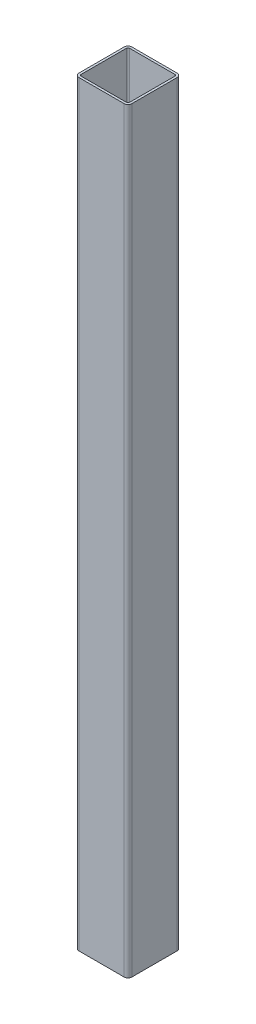
ISO-10303-21;
HEADER;
FILE_DESCRIPTION(('STEP AP214'),'2;1');
FILE_NAME('part.step','',(''),(''),'','','');
FILE_SCHEMA(('AUTOMOTIVE_DESIGN { 1 0 10303 214 1 1 1 1 }'));
ENDSEC;
DATA;
#1=APPLICATION_CONTEXT('core data for automotive mechanical design processes');
#2=APPLICATION_PROTOCOL_DEFINITION('international standard','automotive_design',2000,#1);
#3=PRODUCT_CONTEXT('',#1,'mechanical');
#4=PRODUCT('Part','Part','',(#3));
#5=PRODUCT_RELATED_PRODUCT_CATEGORY('part','',(#4));
#6=PRODUCT_DEFINITION_FORMATION('','',#4);
#7=PRODUCT_DEFINITION_CONTEXT('part definition',#1,'design');
#8=PRODUCT_DEFINITION('design','',#6,#7);
#9=PRODUCT_DEFINITION_SHAPE('','',#8);
#10=(LENGTH_UNIT() NAMED_UNIT(*) SI_UNIT(.MILLI.,.METRE.));
#11=(NAMED_UNIT(*) PLANE_ANGLE_UNIT() SI_UNIT($,.RADIAN.));
#12=(NAMED_UNIT(*) SI_UNIT($,.STERADIAN.) SOLID_ANGLE_UNIT());
#13=UNCERTAINTY_MEASURE_WITH_UNIT(LENGTH_MEASURE(1.E-05),#10,'distance_accuracy_value','');
#14=(GEOMETRIC_REPRESENTATION_CONTEXT(3) GLOBAL_UNCERTAINTY_ASSIGNED_CONTEXT((#13)) GLOBAL_UNIT_ASSIGNED_CONTEXT((#10,
#11,#12)) REPRESENTATION_CONTEXT('',''));
#15=CARTESIAN_POINT('',(0.,0.,0.));
#16=DIRECTION('',(0.,0.,1.));
#17=DIRECTION('',(1.,0.,0.));
#18=AXIS2_PLACEMENT_3D('',#15,#16,#17);
#19=CARTESIAN_POINT('',(30.,1000.,30.));
#20=DIRECTION('',(0.,1.,0.));
#21=DIRECTION('',(0.,0.,1.));
#22=AXIS2_PLACEMENT_3D('',#19,#20,#21);
#23=PLANE('',#22);
#24=CARTESIAN_POINT('',(30.,1000.,30.));
#25=DIRECTION('',(0.,1.,0.));
#26=DIRECTION('',(0.,0.,1.));
#27=AXIS2_PLACEMENT_3D('',#24,#25,#26);
#28=CIRCLE('',#27,5.);
#29=CARTESIAN_POINT('',(30.,1000.,35.));
#30=VERTEX_POINT('',#29);
#31=CARTESIAN_POINT('',(35.,1000.,30.));
#32=VERTEX_POINT('',#31);
#33=EDGE_CURVE('E262',#30,#32,#28,.T.);
#34=ORIENTED_EDGE('',*,*,#33,.T.);
#35=DIRECTION('',(0.,0.,-1.));
#36=VECTOR('',#35,1.);
#37=CARTESIAN_POINT('',(35.,1000.,-30.));
#38=LINE('',#37,#36);
#39=CARTESIAN_POINT('',(35.,1000.,-30.));
#40=VERTEX_POINT('',#39);
#41=EDGE_CURVE('E265',#32,#40,#38,.T.);
#42=ORIENTED_EDGE('',*,*,#41,.T.);
#43=CARTESIAN_POINT('',(30.,1000.,-30.));
#44=DIRECTION('',(0.,1.,0.));
#45=DIRECTION('',(0.,0.,-1.));
#46=AXIS2_PLACEMENT_3D('',#43,#44,#45);
#47=CIRCLE('',#46,5.00000000000001);
#48=CARTESIAN_POINT('',(30.,1000.,-35.));
#49=VERTEX_POINT('',#48);
#50=EDGE_CURVE('E268',#40,#49,#47,.T.);
#51=ORIENTED_EDGE('',*,*,#50,.T.);
#52=DIRECTION('',(-1.,0.,0.));
#53=VECTOR('',#52,1.);
#54=CARTESIAN_POINT('',(-30.,1000.,-35.));
#55=LINE('',#54,#53);
#56=CARTESIAN_POINT('',(-30.,1000.,-35.));
#57=VERTEX_POINT('',#56);
#58=EDGE_CURVE('E270',#49,#57,#55,.T.);
#59=ORIENTED_EDGE('',*,*,#58,.T.);
#60=CARTESIAN_POINT('',(-30.,1000.,-30.));
#61=DIRECTION('',(0.,1.,0.));
#62=DIRECTION('',(0.,0.,1.));
#63=AXIS2_PLACEMENT_3D('',#60,#61,#62);
#64=CIRCLE('',#63,5.);
#65=CARTESIAN_POINT('',(-35.,1000.,-30.));
#66=VERTEX_POINT('',#65);
#67=EDGE_CURVE('E272',#57,#66,#64,.T.);
#68=ORIENTED_EDGE('',*,*,#67,.T.);
#69=DIRECTION('',(0.,0.,1.));
#70=VECTOR('',#69,1.);
#71=CARTESIAN_POINT('',(-35.,1000.,-30.));
#72=LINE('',#71,#70);
#73=CARTESIAN_POINT('',(-35.,1000.,30.));
#74=VERTEX_POINT('',#73);
#75=EDGE_CURVE('E274',#66,#74,#72,.T.);
#76=ORIENTED_EDGE('',*,*,#75,.T.);
#77=CARTESIAN_POINT('',(-30.,1000.,30.));
#78=DIRECTION('',(0.,1.,0.));
#79=DIRECTION('',(0.,0.,1.));
#80=AXIS2_PLACEMENT_3D('',#77,#78,#79);
#81=CIRCLE('',#80,5.);
#82=CARTESIAN_POINT('',(-30.,1000.,35.));
#83=VERTEX_POINT('',#82);
#84=EDGE_CURVE('E276',#74,#83,#81,.T.);
#85=ORIENTED_EDGE('',*,*,#84,.T.);
#86=DIRECTION('',(1.,0.,0.));
#87=VECTOR('',#86,1.);
#88=CARTESIAN_POINT('',(-30.,1000.,35.));
#89=LINE('',#88,#87);
#90=EDGE_CURVE('E278',#83,#30,#89,.T.);
#91=ORIENTED_EDGE('',*,*,#90,.T.);
#92=EDGE_LOOP('',(#34,#42,#51,#59,#68,#76,#85,#91));
#93=FACE_BOUND('',#92,.T.);
#94=DIRECTION('',(0.,0.,-1.));
#95=VECTOR('',#94,1.);
#96=CARTESIAN_POINT('',(32.,1000.,-30.));
#97=LINE('',#96,#95);
#98=CARTESIAN_POINT('',(32.,1000.,30.));
#99=VERTEX_POINT('',#98);
#100=CARTESIAN_POINT('',(32.,1000.,-30.));
#101=VERTEX_POINT('',#100);
#102=EDGE_CURVE('E205',#99,#101,#97,.T.);
#103=ORIENTED_EDGE('',*,*,#102,.F.);
#104=CARTESIAN_POINT('',(30.,1000.,30.));
#105=DIRECTION('',(0.,1.,0.));
#106=DIRECTION('',(1.,0.,0.));
#107=AXIS2_PLACEMENT_3D('',#104,#105,#106);
#108=CIRCLE('',#107,2.);
#109=CARTESIAN_POINT('',(30.,1000.,32.));
#110=VERTEX_POINT('',#109);
#111=EDGE_CURVE('E197',#110,#99,#108,.T.);
#112=ORIENTED_EDGE('',*,*,#111,.F.);
#113=DIRECTION('',(1.,0.,0.));
#114=VECTOR('',#113,1.);
#115=CARTESIAN_POINT('',(-30.,1000.,32.));
#116=LINE('',#115,#114);
#117=CARTESIAN_POINT('',(-30.,1000.,32.));
#118=VERTEX_POINT('',#117);
#119=EDGE_CURVE('E230',#118,#110,#116,.T.);
#120=ORIENTED_EDGE('',*,*,#119,.F.);
#121=CARTESIAN_POINT('',(-30.,1000.,30.));
#122=DIRECTION('',(0.,1.,0.));
#123=DIRECTION('',(1.,0.,0.));
#124=AXIS2_PLACEMENT_3D('',#121,#122,#123);
#125=CIRCLE('',#124,2.);
#126=CARTESIAN_POINT('',(-32.,1000.,30.));
#127=VERTEX_POINT('',#126);
#128=EDGE_CURVE('E228',#127,#118,#125,.T.);
#129=ORIENTED_EDGE('',*,*,#128,.F.);
#130=DIRECTION('',(0.,0.,1.));
#131=VECTOR('',#130,1.);
#132=CARTESIAN_POINT('',(-32.,1000.,-30.));
#133=LINE('',#132,#131);
#134=CARTESIAN_POINT('',(-32.,1000.,-30.));
#135=VERTEX_POINT('',#134);
#136=EDGE_CURVE('E226',#135,#127,#133,.T.);
#137=ORIENTED_EDGE('',*,*,#136,.F.);
#138=CARTESIAN_POINT('',(-30.,1000.,-30.));
#139=DIRECTION('',(0.,1.,0.));
#140=DIRECTION('',(1.,0.,0.));
#141=AXIS2_PLACEMENT_3D('',#138,#139,#140);
#142=CIRCLE('',#141,2.);
#143=CARTESIAN_POINT('',(-30.,1000.,-32.));
#144=VERTEX_POINT('',#143);
#145=EDGE_CURVE('E224',#144,#135,#142,.T.);
#146=ORIENTED_EDGE('',*,*,#145,.F.);
#147=DIRECTION('',(-1.,0.,0.));
#148=VECTOR('',#147,1.);
#149=CARTESIAN_POINT('',(-30.,1000.,-32.));
#150=LINE('',#149,#148);
#151=CARTESIAN_POINT('',(30.,1000.,-32.));
#152=VERTEX_POINT('',#151);
#153=EDGE_CURVE('E220',#152,#144,#150,.T.);
#154=ORIENTED_EDGE('',*,*,#153,.F.);
#155=CARTESIAN_POINT('',(30.,1000.,-30.));
#156=DIRECTION('',(0.,1.,0.));
#157=DIRECTION('',(1.,0.,0.));
#158=AXIS2_PLACEMENT_3D('',#155,#156,#157);
#159=CIRCLE('',#158,2.00000000000001);
#160=EDGE_CURVE('E218',#101,#152,#159,.T.);
#161=ORIENTED_EDGE('',*,*,#160,.F.);
#162=EDGE_LOOP('',(#103,#112,#120,#129,#137,#146,#154,#161));
#163=FACE_BOUND('',#162,.T.);
#164=ADVANCED_FACE('F84',(#93,#163),#23,.T.);
#165=CARTESIAN_POINT('',(30.,0.,30.));
#166=DIRECTION('',(0.,1.,0.));
#167=DIRECTION('',(0.,0.,1.));
#168=AXIS2_PLACEMENT_3D('',#165,#166,#167);
#169=PLANE('',#168);
#170=CARTESIAN_POINT('',(30.,0.,30.));
#171=DIRECTION('',(0.,1.,0.));
#172=DIRECTION('',(0.,0.,1.));
#173=AXIS2_PLACEMENT_3D('',#170,#171,#172);
#174=CIRCLE('',#173,5.);
#175=CARTESIAN_POINT('',(30.,0.,35.));
#176=VERTEX_POINT('',#175);
#177=CARTESIAN_POINT('',(35.,0.,30.));
#178=VERTEX_POINT('',#177);
#179=EDGE_CURVE('E213',#176,#178,#174,.T.);
#180=ORIENTED_EDGE('',*,*,#179,.F.);
#181=DIRECTION('',(1.,0.,0.));
#182=VECTOR('',#181,1.);
#183=CARTESIAN_POINT('',(-30.,0.,35.));
#184=LINE('',#183,#182);
#185=CARTESIAN_POINT('',(-30.,0.,35.));
#186=VERTEX_POINT('',#185);
#187=EDGE_CURVE('E266',#186,#176,#184,.T.);
#188=ORIENTED_EDGE('',*,*,#187,.F.);
#189=CARTESIAN_POINT('',(-30.,0.,30.));
#190=DIRECTION('',(0.,1.,0.));
#191=DIRECTION('',(0.,0.,1.));
#192=AXIS2_PLACEMENT_3D('',#189,#190,#191);
#193=CIRCLE('',#192,5.);
#194=CARTESIAN_POINT('',(-35.,0.,30.));
#195=VERTEX_POINT('',#194);
#196=EDGE_CURVE('E293',#195,#186,#193,.T.);
#197=ORIENTED_EDGE('',*,*,#196,.F.);
#198=DIRECTION('',(0.,0.,1.));
#199=VECTOR('',#198,1.);
#200=CARTESIAN_POINT('',(-35.,0.,-30.));
#201=LINE('',#200,#199);
#202=CARTESIAN_POINT('',(-35.,0.,-30.));
#203=VERTEX_POINT('',#202);
#204=EDGE_CURVE('E291',#203,#195,#201,.T.);
#205=ORIENTED_EDGE('',*,*,#204,.F.);
#206=CARTESIAN_POINT('',(-30.,0.,-30.));
#207=DIRECTION('',(0.,1.,0.));
#208=DIRECTION('',(0.,0.,1.));
#209=AXIS2_PLACEMENT_3D('',#206,#207,#208);
#210=CIRCLE('',#209,5.);
#211=CARTESIAN_POINT('',(-30.,0.,-35.));
#212=VERTEX_POINT('',#211);
#213=EDGE_CURVE('E289',#212,#203,#210,.T.);
#214=ORIENTED_EDGE('',*,*,#213,.F.);
#215=DIRECTION('',(-1.,0.,0.));
#216=VECTOR('',#215,1.);
#217=CARTESIAN_POINT('',(-30.,0.,-35.));
#218=LINE('',#217,#216);
#219=CARTESIAN_POINT('',(30.,0.,-35.));
#220=VERTEX_POINT('',#219);
#221=EDGE_CURVE('E287',#220,#212,#218,.T.);
#222=ORIENTED_EDGE('',*,*,#221,.F.);
#223=CARTESIAN_POINT('',(30.,0.,-30.));
#224=DIRECTION('',(0.,1.,0.));
#225=DIRECTION('',(0.,0.,-1.));
#226=AXIS2_PLACEMENT_3D('',#223,#224,#225);
#227=CIRCLE('',#226,5.00000000000001);
#228=CARTESIAN_POINT('',(35.,0.,-30.));
#229=VERTEX_POINT('',#228);
#230=EDGE_CURVE('E285',#229,#220,#227,.T.);
#231=ORIENTED_EDGE('',*,*,#230,.F.);
#232=DIRECTION('',(0.,0.,-1.));
#233=VECTOR('',#232,1.);
#234=CARTESIAN_POINT('',(35.,0.,-30.));
#235=LINE('',#234,#233);
#236=EDGE_CURVE('E283',#178,#229,#235,.T.);
#237=ORIENTED_EDGE('',*,*,#236,.F.);
#238=EDGE_LOOP('',(#180,#188,#197,#205,#214,#222,#231,#237));
#239=FACE_BOUND('',#238,.T.);
#240=CARTESIAN_POINT('',(30.,0.,30.));
#241=DIRECTION('',(0.,1.,0.));
#242=DIRECTION('',(1.,0.,0.));
#243=AXIS2_PLACEMENT_3D('',#240,#241,#242);
#244=CIRCLE('',#243,2.);
#245=CARTESIAN_POINT('',(30.,0.,32.));
#246=VERTEX_POINT('',#245);
#247=CARTESIAN_POINT('',(32.,0.,30.));
#248=VERTEX_POINT('',#247);
#249=EDGE_CURVE('E107',#246,#248,#244,.T.);
#250=ORIENTED_EDGE('',*,*,#249,.T.);
#251=DIRECTION('',(0.,0.,-1.));
#252=VECTOR('',#251,1.);
#253=CARTESIAN_POINT('',(32.,0.,-30.));
#254=LINE('',#253,#252);
#255=CARTESIAN_POINT('',(32.,0.,-30.));
#256=VERTEX_POINT('',#255);
#257=EDGE_CURVE('E212',#248,#256,#254,.T.);
#258=ORIENTED_EDGE('',*,*,#257,.T.);
#259=CARTESIAN_POINT('',(30.,0.,-30.));
#260=DIRECTION('',(0.,1.,0.));
#261=DIRECTION('',(1.,0.,0.));
#262=AXIS2_PLACEMENT_3D('',#259,#260,#261);
#263=CIRCLE('',#262,2.00000000000001);
#264=CARTESIAN_POINT('',(30.,0.,-32.));
#265=VERTEX_POINT('',#264);
#266=EDGE_CURVE('E234',#256,#265,#263,.T.);
#267=ORIENTED_EDGE('',*,*,#266,.T.);
#268=DIRECTION('',(-1.,0.,0.));
#269=VECTOR('',#268,1.);
#270=CARTESIAN_POINT('',(-30.,0.,-32.));
#271=LINE('',#270,#269);
#272=CARTESIAN_POINT('',(-30.,0.,-32.));
#273=VERTEX_POINT('',#272);
#274=EDGE_CURVE('E237',#265,#273,#271,.T.);
#275=ORIENTED_EDGE('',*,*,#274,.T.);
#276=CARTESIAN_POINT('',(-30.,0.,-30.));
#277=DIRECTION('',(0.,1.,0.));
#278=DIRECTION('',(1.,0.,0.));
#279=AXIS2_PLACEMENT_3D('',#276,#277,#278);
#280=CIRCLE('',#279,2.);
#281=CARTESIAN_POINT('',(-32.,0.,-30.));
#282=VERTEX_POINT('',#281);
#283=EDGE_CURVE('E240',#273,#282,#280,.T.);
#284=ORIENTED_EDGE('',*,*,#283,.T.);
#285=DIRECTION('',(0.,0.,1.));
#286=VECTOR('',#285,1.);
#287=CARTESIAN_POINT('',(-32.,0.,-30.));
#288=LINE('',#287,#286);
#289=CARTESIAN_POINT('',(-32.,0.,30.));
#290=VERTEX_POINT('',#289);
#291=EDGE_CURVE('E243',#282,#290,#288,.T.);
#292=ORIENTED_EDGE('',*,*,#291,.T.);
#293=CARTESIAN_POINT('',(-30.,0.,30.));
#294=DIRECTION('',(0.,1.,0.));
#295=DIRECTION('',(1.,0.,0.));
#296=AXIS2_PLACEMENT_3D('',#293,#294,#295);
#297=CIRCLE('',#296,2.);
#298=CARTESIAN_POINT('',(-30.,0.,32.));
#299=VERTEX_POINT('',#298);
#300=EDGE_CURVE('E246',#290,#299,#297,.T.);
#301=ORIENTED_EDGE('',*,*,#300,.T.);
#302=DIRECTION('',(1.,0.,0.));
#303=VECTOR('',#302,1.);
#304=CARTESIAN_POINT('',(-30.,0.,32.));
#305=LINE('',#304,#303);
#306=EDGE_CURVE('E206',#299,#246,#305,.T.);
#307=ORIENTED_EDGE('',*,*,#306,.T.);
#308=EDGE_LOOP('',(#250,#258,#267,#275,#284,#292,#301,#307));
#309=FACE_BOUND('',#308,.T.);
#310=ADVANCED_FACE('F323',(#239,#309),#169,.F.);
#311=CARTESIAN_POINT('',(30.,1000.,30.));
#312=DIRECTION('',(0.,-1.,0.));
#313=DIRECTION('',(0.,0.,-1.));
#314=AXIS2_PLACEMENT_3D('',#311,#312,#313);
#315=CYLINDRICAL_SURFACE('',#314,5.);
#316=ORIENTED_EDGE('',*,*,#179,.T.);
#317=DIRECTION('',(0.,-1.,0.));
#318=VECTOR('',#317,1.);
#319=CARTESIAN_POINT('',(35.,1000.,30.));
#320=LINE('',#319,#318);
#321=EDGE_CURVE('E12',#32,#178,#320,.T.);
#322=ORIENTED_EDGE('',*,*,#321,.F.);
#323=ORIENTED_EDGE('',*,*,#33,.F.);
#324=DIRECTION('',(0.,-1.,0.));
#325=VECTOR('',#324,1.);
#326=CARTESIAN_POINT('',(30.,1000.,35.));
#327=LINE('',#326,#325);
#328=EDGE_CURVE('E280',#30,#176,#327,.T.);
#329=ORIENTED_EDGE('',*,*,#328,.T.);
#330=EDGE_LOOP('',(#316,#322,#323,#329));
#331=FACE_BOUND('',#330,.T.);
#332=ADVANCED_FACE('F86',(#331),#315,.T.);
#333=CARTESIAN_POINT('',(35.,1000.,-30.));
#334=DIRECTION('',(-1.,0.,0.));
#335=DIRECTION('',(0.,0.,1.));
#336=AXIS2_PLACEMENT_3D('',#333,#334,#335);
#337=PLANE('',#336);
#338=ORIENTED_EDGE('',*,*,#236,.T.);
#339=DIRECTION('',(0.,-1.,0.));
#340=VECTOR('',#339,1.);
#341=CARTESIAN_POINT('',(35.,1000.,-30.));
#342=LINE('',#341,#340);
#343=EDGE_CURVE('E92',#40,#229,#342,.T.);
#344=ORIENTED_EDGE('',*,*,#343,.F.);
#345=ORIENTED_EDGE('',*,*,#41,.F.);
#346=ORIENTED_EDGE('',*,*,#321,.T.);
#347=EDGE_LOOP('',(#338,#344,#345,#346));
#348=FACE_BOUND('',#347,.T.);
#349=ADVANCED_FACE('F340',(#348),#337,.F.);
#350=CARTESIAN_POINT('',(30.,1000.,-30.));
#351=DIRECTION('',(0.,-1.,0.));
#352=DIRECTION('',(0.,0.,-1.));
#353=AXIS2_PLACEMENT_3D('',#350,#351,#352);
#354=CYLINDRICAL_SURFACE('',#353,5.00000000000001);
#355=ORIENTED_EDGE('',*,*,#230,.T.);
#356=DIRECTION('',(0.,-1.,0.));
#357=VECTOR('',#356,1.);
#358=CARTESIAN_POINT('',(30.,1000.,-35.));
#359=LINE('',#358,#357);
#360=EDGE_CURVE('E310',#49,#220,#359,.T.);
#361=ORIENTED_EDGE('',*,*,#360,.F.);
#362=ORIENTED_EDGE('',*,*,#50,.F.);
#363=ORIENTED_EDGE('',*,*,#343,.T.);
#364=EDGE_LOOP('',(#355,#361,#362,#363));
#365=FACE_BOUND('',#364,.T.);
#366=ADVANCED_FACE('F317',(#365),#354,.T.);
#367=CARTESIAN_POINT('',(-30.,1000.,-35.));
#368=DIRECTION('',(0.,0.,1.));
#369=DIRECTION('',(1.,0.,0.));
#370=AXIS2_PLACEMENT_3D('',#367,#368,#369);
#371=PLANE('',#370);
#372=ORIENTED_EDGE('',*,*,#221,.T.);
#373=DIRECTION('',(0.,-1.,0.));
#374=VECTOR('',#373,1.);
#375=CARTESIAN_POINT('',(-30.,1000.,-35.));
#376=LINE('',#375,#374);
#377=EDGE_CURVE('E307',#57,#212,#376,.T.);
#378=ORIENTED_EDGE('',*,*,#377,.F.);
#379=ORIENTED_EDGE('',*,*,#58,.F.);
#380=ORIENTED_EDGE('',*,*,#360,.T.);
#381=EDGE_LOOP('',(#372,#378,#379,#380));
#382=FACE_BOUND('',#381,.T.);
#383=ADVANCED_FACE('F329',(#382),#371,.F.);
#384=CARTESIAN_POINT('',(-30.,1000.,-30.));
#385=DIRECTION('',(0.,-1.,0.));
#386=DIRECTION('',(0.,0.,-1.));
#387=AXIS2_PLACEMENT_3D('',#384,#385,#386);
#388=CYLINDRICAL_SURFACE('',#387,5.);
#389=ORIENTED_EDGE('',*,*,#213,.T.);
#390=DIRECTION('',(0.,-1.,0.));
#391=VECTOR('',#390,1.);
#392=CARTESIAN_POINT('',(-35.,1000.,-30.));
#393=LINE('',#392,#391);
#394=EDGE_CURVE('E304',#66,#203,#393,.T.);
#395=ORIENTED_EDGE('',*,*,#394,.F.);
#396=ORIENTED_EDGE('',*,*,#67,.F.);
#397=ORIENTED_EDGE('',*,*,#377,.T.);
#398=EDGE_LOOP('',(#389,#395,#396,#397));
#399=FACE_BOUND('',#398,.T.);
#400=ADVANCED_FACE('F333',(#399),#388,.T.);
#401=CARTESIAN_POINT('',(-35.,1000.,-30.));
#402=DIRECTION('',(1.,0.,0.));
#403=DIRECTION('',(0.,0.,-1.));
#404=AXIS2_PLACEMENT_3D('',#401,#402,#403);
#405=PLANE('',#404);
#406=ORIENTED_EDGE('',*,*,#204,.T.);
#407=DIRECTION('',(0.,-1.,0.));
#408=VECTOR('',#407,1.);
#409=CARTESIAN_POINT('',(-35.,1000.,30.));
#410=LINE('',#409,#408);
#411=EDGE_CURVE('E301',#74,#195,#410,.T.);
#412=ORIENTED_EDGE('',*,*,#411,.F.);
#413=ORIENTED_EDGE('',*,*,#75,.F.);
#414=ORIENTED_EDGE('',*,*,#394,.T.);
#415=EDGE_LOOP('',(#406,#412,#413,#414));
#416=FACE_BOUND('',#415,.T.);
#417=ADVANCED_FACE('F353',(#416),#405,.F.);
#418=CARTESIAN_POINT('',(-30.,1000.,30.));
#419=DIRECTION('',(0.,-1.,0.));
#420=DIRECTION('',(0.,0.,-1.));
#421=AXIS2_PLACEMENT_3D('',#418,#419,#420);
#422=CYLINDRICAL_SURFACE('',#421,5.);
#423=ORIENTED_EDGE('',*,*,#196,.T.);
#424=DIRECTION('',(0.,-1.,0.));
#425=VECTOR('',#424,1.);
#426=CARTESIAN_POINT('',(-30.,1000.,35.));
#427=LINE('',#426,#425);
#428=EDGE_CURVE('E298',#83,#186,#427,.T.);
#429=ORIENTED_EDGE('',*,*,#428,.F.);
#430=ORIENTED_EDGE('',*,*,#84,.F.);
#431=ORIENTED_EDGE('',*,*,#411,.T.);
#432=EDGE_LOOP('',(#423,#429,#430,#431));
#433=FACE_BOUND('',#432,.T.);
#434=ADVANCED_FACE('F351',(#433),#422,.T.);
#435=CARTESIAN_POINT('',(-30.,1000.,35.));
#436=DIRECTION('',(0.,0.,-1.));
#437=DIRECTION('',(-1.,0.,0.));
#438=AXIS2_PLACEMENT_3D('',#435,#436,#437);
#439=PLANE('',#438);
#440=ORIENTED_EDGE('',*,*,#187,.T.);
#441=ORIENTED_EDGE('',*,*,#328,.F.);
#442=ORIENTED_EDGE('',*,*,#90,.F.);
#443=ORIENTED_EDGE('',*,*,#428,.T.);
#444=EDGE_LOOP('',(#440,#441,#442,#443));
#445=FACE_BOUND('',#444,.T.);
#446=ADVANCED_FACE('F346',(#445),#439,.F.);
#447=CARTESIAN_POINT('',(30.,1000.,30.));
#448=DIRECTION('',(0.,-1.,0.));
#449=DIRECTION('',(0.,0.,-1.));
#450=AXIS2_PLACEMENT_3D('',#447,#448,#449);
#451=CYLINDRICAL_SURFACE('',#450,2.);
#452=ORIENTED_EDGE('',*,*,#249,.F.);
#453=DIRECTION('',(0.,-1.,0.));
#454=VECTOR('',#453,1.);
#455=CARTESIAN_POINT('',(30.,1000.,32.));
#456=LINE('',#455,#454);
#457=EDGE_CURVE('E201',#110,#246,#456,.T.);
#458=ORIENTED_EDGE('',*,*,#457,.F.);
#459=ORIENTED_EDGE('',*,*,#111,.T.);
#460=DIRECTION('',(0.,-1.,0.));
#461=VECTOR('',#460,1.);
#462=CARTESIAN_POINT('',(32.,1000.,30.));
#463=LINE('',#462,#461);
#464=EDGE_CURVE('E200',#99,#248,#463,.T.);
#465=ORIENTED_EDGE('',*,*,#464,.T.);
#466=EDGE_LOOP('',(#452,#458,#459,#465));
#467=FACE_BOUND('',#466,.T.);
#468=ADVANCED_FACE('F199',(#467),#451,.F.);
#469=CARTESIAN_POINT('',(32.,1000.,-30.));
#470=DIRECTION('',(-1.,0.,0.));
#471=DIRECTION('',(0.,0.,1.));
#472=AXIS2_PLACEMENT_3D('',#469,#470,#471);
#473=PLANE('',#472);
#474=ORIENTED_EDGE('',*,*,#257,.F.);
#475=ORIENTED_EDGE('',*,*,#464,.F.);
#476=ORIENTED_EDGE('',*,*,#102,.T.);
#477=DIRECTION('',(0.,-1.,0.));
#478=VECTOR('',#477,1.);
#479=CARTESIAN_POINT('',(32.,1000.,-30.));
#480=LINE('',#479,#478);
#481=EDGE_CURVE('E214',#101,#256,#480,.T.);
#482=ORIENTED_EDGE('',*,*,#481,.T.);
#483=EDGE_LOOP('',(#474,#475,#476,#482));
#484=FACE_BOUND('',#483,.T.);
#485=ADVANCED_FACE('F209',(#484),#473,.T.);
#486=CARTESIAN_POINT('',(30.,1000.,-30.));
#487=DIRECTION('',(0.,-1.,0.));
#488=DIRECTION('',(0.,0.,-1.));
#489=AXIS2_PLACEMENT_3D('',#486,#487,#488);
#490=CYLINDRICAL_SURFACE('',#489,2.00000000000001);
#491=ORIENTED_EDGE('',*,*,#266,.F.);
#492=ORIENTED_EDGE('',*,*,#481,.F.);
#493=ORIENTED_EDGE('',*,*,#160,.T.);
#494=DIRECTION('',(0.,-1.,0.));
#495=VECTOR('',#494,1.);
#496=CARTESIAN_POINT('',(30.,1000.,-32.));
#497=LINE('',#496,#495);
#498=EDGE_CURVE('E259',#152,#265,#497,.T.);
#499=ORIENTED_EDGE('',*,*,#498,.T.);
#500=EDGE_LOOP('',(#491,#492,#493,#499));
#501=FACE_BOUND('',#500,.T.);
#502=ADVANCED_FACE('F378',(#501),#490,.F.);
#503=CARTESIAN_POINT('',(-30.,1000.,-32.));
#504=DIRECTION('',(0.,0.,1.));
#505=DIRECTION('',(1.,0.,0.));
#506=AXIS2_PLACEMENT_3D('',#503,#504,#505);
#507=PLANE('',#506);
#508=ORIENTED_EDGE('',*,*,#274,.F.);
#509=ORIENTED_EDGE('',*,*,#498,.F.);
#510=ORIENTED_EDGE('',*,*,#153,.T.);
#511=DIRECTION('',(0.,-1.,0.));
#512=VECTOR('',#511,1.);
#513=CARTESIAN_POINT('',(-30.,1000.,-32.));
#514=LINE('',#513,#512);
#515=EDGE_CURVE('E257',#144,#273,#514,.T.);
#516=ORIENTED_EDGE('',*,*,#515,.T.);
#517=EDGE_LOOP('',(#508,#509,#510,#516));
#518=FACE_BOUND('',#517,.T.);
#519=ADVANCED_FACE('F382',(#518),#507,.T.);
#520=CARTESIAN_POINT('',(-30.,1000.,-30.));
#521=DIRECTION('',(0.,-1.,0.));
#522=DIRECTION('',(0.,0.,-1.));
#523=AXIS2_PLACEMENT_3D('',#520,#521,#522);
#524=CYLINDRICAL_SURFACE('',#523,2.);
#525=ORIENTED_EDGE('',*,*,#283,.F.);
#526=ORIENTED_EDGE('',*,*,#515,.F.);
#527=ORIENTED_EDGE('',*,*,#145,.T.);
#528=DIRECTION('',(0.,-1.,0.));
#529=VECTOR('',#528,1.);
#530=CARTESIAN_POINT('',(-32.,1000.,-30.));
#531=LINE('',#530,#529);
#532=EDGE_CURVE('E255',#135,#282,#531,.T.);
#533=ORIENTED_EDGE('',*,*,#532,.T.);
#534=EDGE_LOOP('',(#525,#526,#527,#533));
#535=FACE_BOUND('',#534,.T.);
#536=ADVANCED_FACE('F388',(#535),#524,.F.);
#537=CARTESIAN_POINT('',(-32.,1000.,-30.));
#538=DIRECTION('',(1.,0.,0.));
#539=DIRECTION('',(0.,0.,-1.));
#540=AXIS2_PLACEMENT_3D('',#537,#538,#539);
#541=PLANE('',#540);
#542=ORIENTED_EDGE('',*,*,#291,.F.);
#543=ORIENTED_EDGE('',*,*,#532,.F.);
#544=ORIENTED_EDGE('',*,*,#136,.T.);
#545=DIRECTION('',(0.,-1.,0.));
#546=VECTOR('',#545,1.);
#547=CARTESIAN_POINT('',(-32.,1000.,30.));
#548=LINE('',#547,#546);
#549=EDGE_CURVE('E253',#127,#290,#548,.T.);
#550=ORIENTED_EDGE('',*,*,#549,.T.);
#551=EDGE_LOOP('',(#542,#543,#544,#550));
#552=FACE_BOUND('',#551,.T.);
#553=ADVANCED_FACE('F392',(#552),#541,.T.);
#554=CARTESIAN_POINT('',(-30.,1000.,30.));
#555=DIRECTION('',(0.,-1.,0.));
#556=DIRECTION('',(0.,0.,-1.));
#557=AXIS2_PLACEMENT_3D('',#554,#555,#556);
#558=CYLINDRICAL_SURFACE('',#557,2.);
#559=ORIENTED_EDGE('',*,*,#300,.F.);
#560=ORIENTED_EDGE('',*,*,#549,.F.);
#561=ORIENTED_EDGE('',*,*,#128,.T.);
#562=DIRECTION('',(0.,-1.,0.));
#563=VECTOR('',#562,1.);
#564=CARTESIAN_POINT('',(-30.,1000.,32.));
#565=LINE('',#564,#563);
#566=EDGE_CURVE('E99',#118,#299,#565,.T.);
#567=ORIENTED_EDGE('',*,*,#566,.T.);
#568=EDGE_LOOP('',(#559,#560,#561,#567));
#569=FACE_BOUND('',#568,.T.);
#570=ADVANCED_FACE('F396',(#569),#558,.F.);
#571=CARTESIAN_POINT('',(-30.,1000.,32.));
#572=DIRECTION('',(0.,0.,-1.));
#573=DIRECTION('',(-1.,0.,0.));
#574=AXIS2_PLACEMENT_3D('',#571,#572,#573);
#575=PLANE('',#574);
#576=ORIENTED_EDGE('',*,*,#306,.F.);
#577=ORIENTED_EDGE('',*,*,#566,.F.);
#578=ORIENTED_EDGE('',*,*,#119,.T.);
#579=ORIENTED_EDGE('',*,*,#457,.T.);
#580=EDGE_LOOP('',(#576,#577,#578,#579));
#581=FACE_BOUND('',#580,.T.);
#582=ADVANCED_FACE('F400',(#581),#575,.T.);
#583=CLOSED_SHELL('',(#164,#310,#332,#349,#366,#383,#400,#417,#434,#446,#468,#485,#502,#519,
#536,#553,#570,#582));
#584=MANIFOLD_SOLID_BREP('B2',#583);
#585=ADVANCED_BREP_SHAPE_REPRESENTATION('',(#18,#584),#14);
#586=SHAPE_DEFINITION_REPRESENTATION(#9,#585);
ENDSEC;
END-ISO-10303-21;
